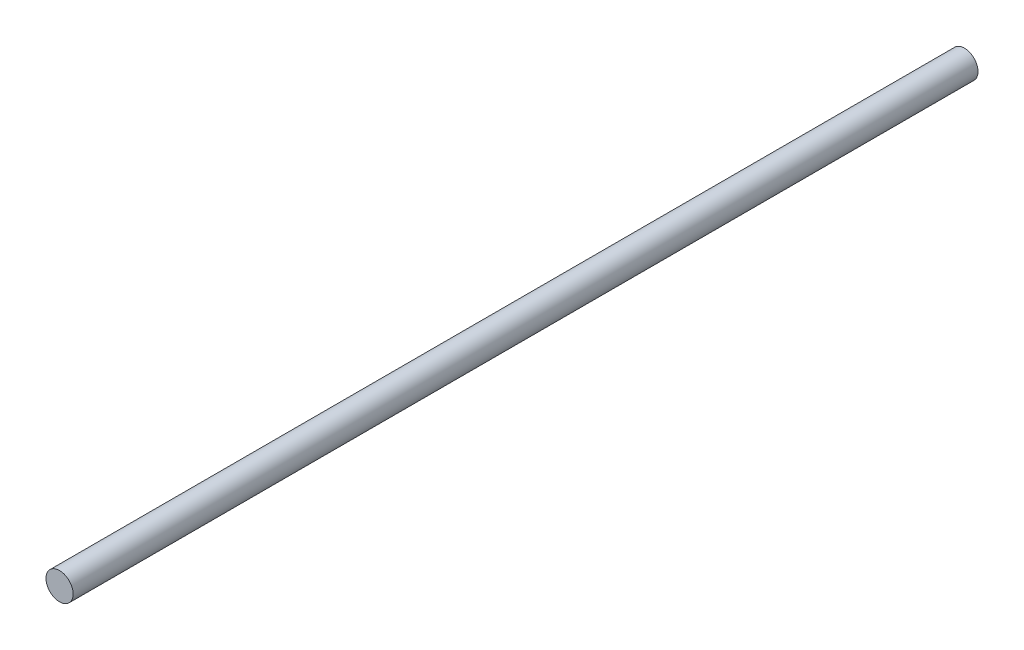
ISO-10303-21;
HEADER;
FILE_DESCRIPTION(('STEP AP214'),'2;1');
FILE_NAME('part.step','',(''),(''),'','','');
FILE_SCHEMA(('AUTOMOTIVE_DESIGN { 1 0 10303 214 1 1 1 1 }'));
ENDSEC;
DATA;
#1=APPLICATION_CONTEXT('core data for automotive mechanical design processes');
#2=APPLICATION_PROTOCOL_DEFINITION('international standard','automotive_design',2000,#1);
#3=PRODUCT_CONTEXT('',#1,'mechanical');
#4=PRODUCT('Part','Part','',(#3));
#5=PRODUCT_RELATED_PRODUCT_CATEGORY('part','',(#4));
#6=PRODUCT_DEFINITION_FORMATION('','',#4);
#7=PRODUCT_DEFINITION_CONTEXT('part definition',#1,'design');
#8=PRODUCT_DEFINITION('design','',#6,#7);
#9=PRODUCT_DEFINITION_SHAPE('','',#8);
#10=(LENGTH_UNIT() NAMED_UNIT(*) SI_UNIT(.MILLI.,.METRE.));
#11=(NAMED_UNIT(*) PLANE_ANGLE_UNIT() SI_UNIT($,.RADIAN.));
#12=(NAMED_UNIT(*) SI_UNIT($,.STERADIAN.) SOLID_ANGLE_UNIT());
#13=UNCERTAINTY_MEASURE_WITH_UNIT(LENGTH_MEASURE(1.E-05),#10,'distance_accuracy_value','');
#14=(GEOMETRIC_REPRESENTATION_CONTEXT(3) GLOBAL_UNCERTAINTY_ASSIGNED_CONTEXT((#13)) GLOBAL_UNIT_ASSIGNED_CONTEXT((#10,
#11,#12)) REPRESENTATION_CONTEXT('',''));
#15=CARTESIAN_POINT('',(0.,0.,0.));
#16=DIRECTION('',(0.,0.,1.));
#17=DIRECTION('',(1.,0.,0.));
#18=AXIS2_PLACEMENT_3D('',#15,#16,#17);
#19=CARTESIAN_POINT('',(0.,0.,-200.));
#20=DIRECTION('',(0.,0.,1.));
#21=DIRECTION('',(1.,0.,0.));
#22=AXIS2_PLACEMENT_3D('',#19,#20,#21);
#23=CYLINDRICAL_SURFACE('',#22,3.);
#24=CARTESIAN_POINT('',(0.,0.,-200.));
#25=DIRECTION('',(0.,0.,1.));
#26=DIRECTION('',(1.,0.,0.));
#27=AXIS2_PLACEMENT_3D('',#24,#25,#26);
#28=CIRCLE('',#27,3.);
#29=CARTESIAN_POINT('',(3.,0.,-200.));
#30=VERTEX_POINT('',#29);
#31=EDGE_CURVE('E10',#30,#30,#28,.T.);
#32=ORIENTED_EDGE('',*,*,#31,.T.);
#33=EDGE_LOOP('',(#32));
#34=FACE_BOUND('',#33,.T.);
#35=CARTESIAN_POINT('',(0.,0.,0.));
#36=DIRECTION('',(0.,0.,1.));
#37=DIRECTION('',(1.,0.,0.));
#38=AXIS2_PLACEMENT_3D('',#35,#36,#37);
#39=CIRCLE('',#38,3.);
#40=CARTESIAN_POINT('',(3.,0.,0.));
#41=VERTEX_POINT('',#40);
#42=EDGE_CURVE('E34',#41,#41,#39,.T.);
#43=ORIENTED_EDGE('',*,*,#42,.F.);
#44=EDGE_LOOP('',(#43));
#45=FACE_BOUND('',#44,.T.);
#46=ADVANCED_FACE('F31',(#34,#45),#23,.T.);
#47=CARTESIAN_POINT('',(0.,0.,-200.));
#48=DIRECTION('',(0.,0.,1.));
#49=DIRECTION('',(1.,0.,0.));
#50=AXIS2_PLACEMENT_3D('',#47,#48,#49);
#51=PLANE('',#50);
#52=ORIENTED_EDGE('',*,*,#31,.F.);
#53=EDGE_LOOP('',(#52));
#54=FACE_BOUND('',#53,.T.);
#55=ADVANCED_FACE('F46',(#54),#51,.F.);
#56=CARTESIAN_POINT('',(0.,0.,0.));
#57=DIRECTION('',(0.,0.,1.));
#58=DIRECTION('',(1.,0.,0.));
#59=AXIS2_PLACEMENT_3D('',#56,#57,#58);
#60=PLANE('',#59);
#61=ORIENTED_EDGE('',*,*,#42,.T.);
#62=EDGE_LOOP('',(#61));
#63=FACE_BOUND('',#62,.T.);
#64=ADVANCED_FACE('F43',(#63),#60,.T.);
#65=CLOSED_SHELL('',(#46,#55,#64));
#66=MANIFOLD_SOLID_BREP('B2',#65);
#67=ADVANCED_BREP_SHAPE_REPRESENTATION('',(#18,#66),#14);
#68=SHAPE_DEFINITION_REPRESENTATION(#9,#67);
ENDSEC;
END-ISO-10303-21;
